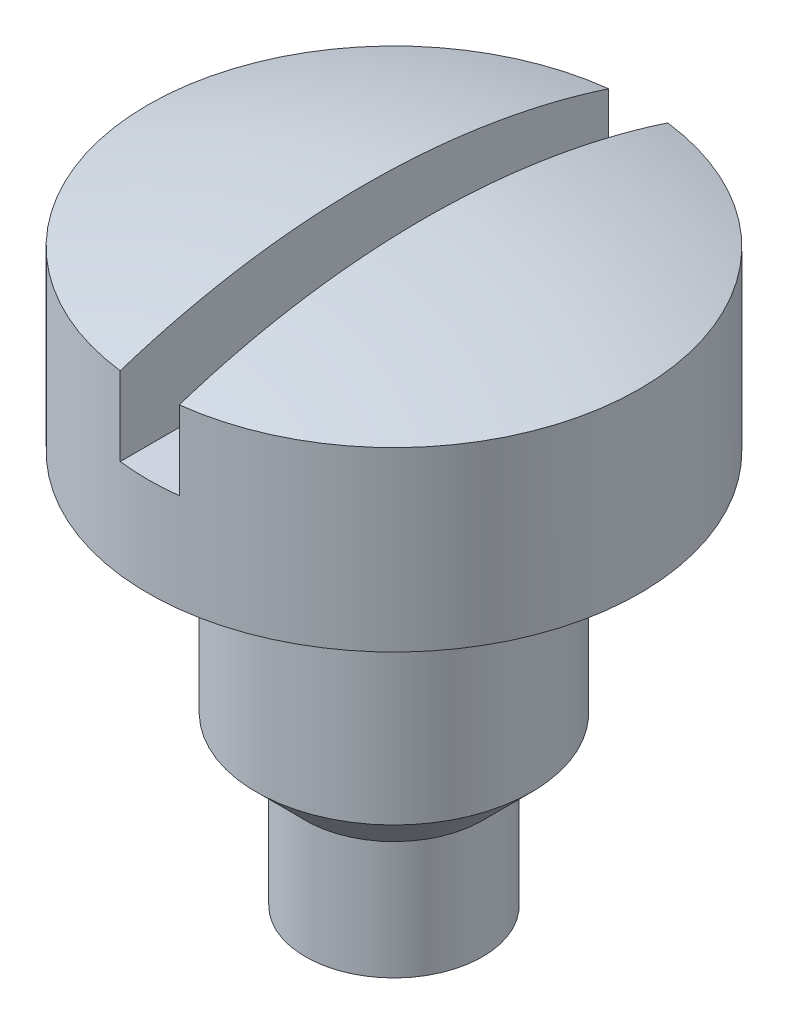
ISO-10303-21;
HEADER;
FILE_DESCRIPTION(('STEP AP214'),'2;1');
FILE_NAME('part.step','',(''),(''),'','','');
FILE_SCHEMA(('AUTOMOTIVE_DESIGN { 1 0 10303 214 1 1 1 1 }'));
ENDSEC;
DATA;
#1=APPLICATION_CONTEXT('core data for automotive mechanical design processes');
#2=APPLICATION_PROTOCOL_DEFINITION('international standard','automotive_design',2000,#1);
#3=PRODUCT_CONTEXT('',#1,'mechanical');
#4=PRODUCT('Part','Part','',(#3));
#5=PRODUCT_RELATED_PRODUCT_CATEGORY('part','',(#4));
#6=PRODUCT_DEFINITION_FORMATION('','',#4);
#7=PRODUCT_DEFINITION_CONTEXT('part definition',#1,'design');
#8=PRODUCT_DEFINITION('design','',#6,#7);
#9=PRODUCT_DEFINITION_SHAPE('','',#8);
#10=(LENGTH_UNIT() NAMED_UNIT(*) SI_UNIT(.MILLI.,.METRE.));
#11=(NAMED_UNIT(*) PLANE_ANGLE_UNIT() SI_UNIT($,.RADIAN.));
#12=(NAMED_UNIT(*) SI_UNIT($,.STERADIAN.) SOLID_ANGLE_UNIT());
#13=UNCERTAINTY_MEASURE_WITH_UNIT(LENGTH_MEASURE(1.E-05),#10,'distance_accuracy_value','');
#14=(GEOMETRIC_REPRESENTATION_CONTEXT(3) GLOBAL_UNCERTAINTY_ASSIGNED_CONTEXT((#13)) GLOBAL_UNIT_ASSIGNED_CONTEXT((#10,
#11,#12)) REPRESENTATION_CONTEXT('',''));
#15=CARTESIAN_POINT('',(0.,0.,0.));
#16=DIRECTION('',(0.,0.,1.));
#17=DIRECTION('',(1.,0.,0.));
#18=AXIS2_PLACEMENT_3D('',#15,#16,#17);
#19=CARTESIAN_POINT('',(0.,-0.899999999999999,0.));
#20=DIRECTION('',(0.,-1.,0.));
#21=DIRECTION('',(-1.,0.,0.));
#22=AXIS2_PLACEMENT_3D('',#19,#20,#21);
#23=SPHERICAL_SURFACE('',#22,4.);
#24=CARTESIAN_POINT('',(0.15,-0.899999999999999,0.));
#25=DIRECTION('',(1.,0.,0.));
#26=DIRECTION('',(0.,1.,0.));
#27=AXIS2_PLACEMENT_3D('',#24,#25,#26);
#28=CIRCLE('',#27,3.99718651053463);
#29=CARTESIAN_POINT('',(0.15,2.89967103839267,-1.24096736459908));
#30=VERTEX_POINT('',#29);
#31=CARTESIAN_POINT('',(0.15,2.89967103839267,1.24096736459908));
#32=VERTEX_POINT('',#31);
#33=EDGE_CURVE('E74',#30,#32,#28,.T.);
#34=ORIENTED_EDGE('',*,*,#33,.T.);
#35=CARTESIAN_POINT('',(0.,2.89967103839267,0.));
#36=DIRECTION('',(0.,-1.,0.));
#37=DIRECTION('',(0.,0.,-1.));
#38=AXIS2_PLACEMENT_3D('',#35,#36,#37);
#39=CIRCLE('',#38,1.25);
#40=EDGE_CURVE('E129',#30,#32,#39,.T.);
#41=ORIENTED_EDGE('',*,*,#40,.F.);
#42=EDGE_LOOP('',(#34,#41));
#43=FACE_BOUND('',#42,.T.);
#44=ADVANCED_FACE('F52',(#43),#23,.T.);
#45=CARTESIAN_POINT('',(0.,2.,0.));
#46=DIRECTION('',(0.,-1.,0.));
#47=DIRECTION('',(0.,0.,-1.));
#48=AXIS2_PLACEMENT_3D('',#45,#46,#47);
#49=CYLINDRICAL_SURFACE('',#48,0.7);
#50=CARTESIAN_POINT('',(0.,0.850000000000002,0.));
#51=DIRECTION('',(0.,-1.,0.));
#52=DIRECTION('',(0.,0.,-1.));
#53=AXIS2_PLACEMENT_3D('',#50,#51,#52);
#54=CIRCLE('',#53,0.7);
#55=CARTESIAN_POINT('',(0.,0.850000000000002,-0.7));
#56=VERTEX_POINT('',#55);
#57=EDGE_CURVE('E132',#56,#56,#54,.F.);
#58=ORIENTED_EDGE('',*,*,#57,.T.);
#59=EDGE_LOOP('',(#58));
#60=FACE_BOUND('',#59,.T.);
#61=CARTESIAN_POINT('',(0.,2.,0.));
#62=DIRECTION('',(0.,-1.,0.));
#63=DIRECTION('',(0.,0.,-1.));
#64=AXIS2_PLACEMENT_3D('',#61,#62,#63);
#65=CIRCLE('',#64,0.7);
#66=CARTESIAN_POINT('',(0.,2.,-0.7));
#67=VERTEX_POINT('',#66);
#68=EDGE_CURVE('E122',#67,#67,#65,.T.);
#69=ORIENTED_EDGE('',*,*,#68,.T.);
#70=EDGE_LOOP('',(#69));
#71=FACE_BOUND('',#70,.T.);
#72=ADVANCED_FACE('F141',(#60,#71),#49,.T.);
#73=CARTESIAN_POINT('',(0.,3.1,0.));
#74=DIRECTION('',(0.,-1.,0.));
#75=DIRECTION('',(0.,0.,-1.));
#76=AXIS2_PLACEMENT_3D('',#73,#74,#75);
#77=CYLINDRICAL_SURFACE('',#76,1.25);
#78=CARTESIAN_POINT('',(0.,2.5,0.));
#79=DIRECTION('',(0.,-1.,0.));
#80=DIRECTION('',(0.,0.,-1.));
#81=AXIS2_PLACEMENT_3D('',#78,#79,#80);
#82=CIRCLE('',#81,1.25);
#83=CARTESIAN_POINT('',(-0.15,2.5,-1.24096736459909));
#84=VERTEX_POINT('',#83);
#85=CARTESIAN_POINT('',(0.15,2.5,-1.24096736459909));
#86=VERTEX_POINT('',#85);
#87=EDGE_CURVE('E14',#84,#86,#82,.T.);
#88=ORIENTED_EDGE('',*,*,#87,.T.);
#89=DIRECTION('',(0.,-1.,0.));
#90=VECTOR('',#89,1.);
#91=CARTESIAN_POINT('',(0.15,3.1,-1.24096736459909));
#92=LINE('',#91,#90);
#93=EDGE_CURVE('E110',#86,#30,#92,.F.);
#94=ORIENTED_EDGE('',*,*,#93,.T.);
#95=ORIENTED_EDGE('',*,*,#40,.T.);
#96=DIRECTION('',(0.,-1.,0.));
#97=VECTOR('',#96,1.);
#98=CARTESIAN_POINT('',(0.15,3.1,1.24096736459909));
#99=LINE('',#98,#97);
#100=CARTESIAN_POINT('',(0.15,2.5,1.24096736459909));
#101=VERTEX_POINT('',#100);
#102=EDGE_CURVE('E112',#32,#101,#99,.T.);
#103=ORIENTED_EDGE('',*,*,#102,.T.);
#104=CARTESIAN_POINT('',(-0.15,2.5,1.24096736459909));
#105=VERTEX_POINT('',#104);
#106=EDGE_CURVE('E56',#101,#105,#82,.T.);
#107=ORIENTED_EDGE('',*,*,#106,.T.);
#108=DIRECTION('',(0.,-1.,0.));
#109=VECTOR('',#108,1.);
#110=CARTESIAN_POINT('',(-0.15,3.1,1.24096736459909));
#111=LINE('',#110,#109);
#112=CARTESIAN_POINT('',(-0.15,2.89967103839267,1.24096736459908));
#113=VERTEX_POINT('',#112);
#114=EDGE_CURVE('E103',#105,#113,#111,.F.);
#115=ORIENTED_EDGE('',*,*,#114,.T.);
#116=CARTESIAN_POINT('',(-0.15,2.89967103839267,-1.24096736459908));
#117=VERTEX_POINT('',#116);
#118=EDGE_CURVE('E109',#113,#117,#39,.T.);
#119=ORIENTED_EDGE('',*,*,#118,.T.);
#120=DIRECTION('',(0.,-1.,0.));
#121=VECTOR('',#120,1.);
#122=CARTESIAN_POINT('',(-0.15,3.1,-1.24096736459909));
#123=LINE('',#122,#121);
#124=EDGE_CURVE('E67',#117,#84,#123,.T.);
#125=ORIENTED_EDGE('',*,*,#124,.T.);
#126=EDGE_LOOP('',(#88,#94,#95,#103,#107,#115,#119,#125));
#127=FACE_BOUND('',#126,.T.);
#128=CARTESIAN_POINT('',(0.,2.,0.));
#129=DIRECTION('',(0.,-1.,0.));
#130=DIRECTION('',(0.,0.,-1.));
#131=AXIS2_PLACEMENT_3D('',#128,#129,#130);
#132=CIRCLE('',#131,1.25);
#133=CARTESIAN_POINT('',(0.,2.,-1.25));
#134=VERTEX_POINT('',#133);
#135=EDGE_CURVE('E127',#134,#134,#132,.T.);
#136=ORIENTED_EDGE('',*,*,#135,.F.);
#137=EDGE_LOOP('',(#136));
#138=FACE_BOUND('',#137,.T.);
#139=ADVANCED_FACE('F106',(#127,#138),#77,.T.);
#140=ORIENTED_EDGE('',*,*,#118,.F.);
#141=CARTESIAN_POINT('',(-0.15,-0.899999999999999,0.));
#142=DIRECTION('',(-1.,0.,0.));
#143=DIRECTION('',(0.,-1.,0.));
#144=AXIS2_PLACEMENT_3D('',#141,#142,#143);
#145=CIRCLE('',#144,3.99718651053463);
#146=EDGE_CURVE('E135',#113,#117,#145,.T.);
#147=ORIENTED_EDGE('',*,*,#146,.T.);
#148=EDGE_LOOP('',(#140,#147));
#149=FACE_BOUND('',#148,.T.);
#150=ADVANCED_FACE('F143',(#149),#23,.T.);
#151=CARTESIAN_POINT('',(0.,2.,0.));
#152=DIRECTION('',(0.,-1.,0.));
#153=DIRECTION('',(0.,0.,-1.));
#154=AXIS2_PLACEMENT_3D('',#151,#152,#153);
#155=PLANE('',#154);
#156=ORIENTED_EDGE('',*,*,#68,.F.);
#157=EDGE_LOOP('',(#156));
#158=FACE_BOUND('',#157,.T.);
#159=ORIENTED_EDGE('',*,*,#135,.T.);
#160=EDGE_LOOP('',(#159));
#161=FACE_BOUND('',#160,.T.);
#162=ADVANCED_FACE('F152',(#158,#161),#155,.T.);
#163=CARTESIAN_POINT('',(0.,0.6,0.));
#164=DIRECTION('',(0.,-1.,0.));
#165=DIRECTION('',(0.,0.,-1.));
#166=AXIS2_PLACEMENT_3D('',#163,#164,#165);
#167=CYLINDRICAL_SURFACE('',#166,0.45);
#168=CARTESIAN_POINT('',(0.,0.6,0.));
#169=DIRECTION('',(0.,-1.,0.));
#170=DIRECTION('',(0.,0.,-1.));
#171=AXIS2_PLACEMENT_3D('',#168,#169,#170);
#172=CIRCLE('',#171,0.45);
#173=CARTESIAN_POINT('',(0.,0.6,-0.45));
#174=VERTEX_POINT('',#173);
#175=EDGE_CURVE('E119',#174,#174,#172,.T.);
#176=ORIENTED_EDGE('',*,*,#175,.T.);
#177=EDGE_LOOP('',(#176));
#178=FACE_BOUND('',#177,.T.);
#179=CARTESIAN_POINT('',(0.,0.,0.));
#180=DIRECTION('',(0.,-1.,0.));
#181=DIRECTION('',(0.,0.,-1.));
#182=AXIS2_PLACEMENT_3D('',#179,#180,#181);
#183=CIRCLE('',#182,0.45);
#184=CARTESIAN_POINT('',(0.,0.,-0.45));
#185=VERTEX_POINT('',#184);
#186=EDGE_CURVE('E118',#185,#185,#183,.T.);
#187=ORIENTED_EDGE('',*,*,#186,.F.);
#188=EDGE_LOOP('',(#187));
#189=FACE_BOUND('',#188,.T.);
#190=ADVANCED_FACE('F158',(#178,#189),#167,.T.);
#191=CARTESIAN_POINT('',(0.,0.,0.));
#192=DIRECTION('',(0.,1.,0.));
#193=DIRECTION('',(0.,0.,1.));
#194=AXIS2_PLACEMENT_3D('',#191,#192,#193);
#195=PLANE('',#194);
#196=ORIENTED_EDGE('',*,*,#186,.T.);
#197=EDGE_LOOP('',(#196));
#198=FACE_BOUND('',#197,.T.);
#199=ADVANCED_FACE('F162',(#198),#195,.F.);
#200=CARTESIAN_POINT('',(0.,0.850000000000002,0.));
#201=DIRECTION('',(0.,1.,0.));
#202=DIRECTION('',(0.,0.,1.));
#203=AXIS2_PLACEMENT_3D('',#200,#201,#202);
#204=CONICAL_SURFACE('',#203,0.7,0.78539816339745);
#205=ORIENTED_EDGE('',*,*,#175,.F.);
#206=EDGE_LOOP('',(#205));
#207=FACE_BOUND('',#206,.T.);
#208=ORIENTED_EDGE('',*,*,#57,.F.);
#209=EDGE_LOOP('',(#208));
#210=FACE_BOUND('',#209,.T.);
#211=ADVANCED_FACE('F54',(#207,#210),#204,.T.);
#212=CARTESIAN_POINT('',(-0.15,2.5,-1.25));
#213=DIRECTION('',(0.,-1.,0.));
#214=DIRECTION('',(0.,0.,-1.));
#215=AXIS2_PLACEMENT_3D('',#212,#213,#214);
#216=PLANE('',#215);
#217=DIRECTION('',(0.,0.,1.));
#218=VECTOR('',#217,1.);
#219=CARTESIAN_POINT('',(0.15,2.5,-1.25));
#220=LINE('',#219,#218);
#221=EDGE_CURVE('E97',#86,#101,#220,.T.);
#222=ORIENTED_EDGE('',*,*,#221,.F.);
#223=ORIENTED_EDGE('',*,*,#87,.F.);
#224=DIRECTION('',(0.,0.,1.));
#225=VECTOR('',#224,1.);
#226=CARTESIAN_POINT('',(-0.15,2.5,-1.25));
#227=LINE('',#226,#225);
#228=EDGE_CURVE('E94',#84,#105,#227,.T.);
#229=ORIENTED_EDGE('',*,*,#228,.T.);
#230=ORIENTED_EDGE('',*,*,#106,.F.);
#231=EDGE_LOOP('',(#222,#223,#229,#230));
#232=FACE_BOUND('',#231,.T.);
#233=ADVANCED_FACE('F93',(#232),#216,.F.);
#234=CARTESIAN_POINT('',(0.15,3.09718651053463,-1.25));
#235=DIRECTION('',(1.,0.,0.));
#236=DIRECTION('',(0.,1.,0.));
#237=AXIS2_PLACEMENT_3D('',#234,#235,#236);
#238=PLANE('',#237);
#239=ORIENTED_EDGE('',*,*,#102,.F.);
#240=ORIENTED_EDGE('',*,*,#33,.F.);
#241=ORIENTED_EDGE('',*,*,#93,.F.);
#242=ORIENTED_EDGE('',*,*,#221,.T.);
#243=EDGE_LOOP('',(#239,#240,#241,#242));
#244=FACE_BOUND('',#243,.T.);
#245=ADVANCED_FACE('F138',(#244),#238,.F.);
#246=CARTESIAN_POINT('',(-0.15,3.09718651053463,-1.25));
#247=DIRECTION('',(-1.,0.,0.));
#248=DIRECTION('',(0.,-1.,0.));
#249=AXIS2_PLACEMENT_3D('',#246,#247,#248);
#250=PLANE('',#249);
#251=ORIENTED_EDGE('',*,*,#146,.F.);
#252=ORIENTED_EDGE('',*,*,#114,.F.);
#253=ORIENTED_EDGE('',*,*,#228,.F.);
#254=ORIENTED_EDGE('',*,*,#124,.F.);
#255=EDGE_LOOP('',(#251,#252,#253,#254));
#256=FACE_BOUND('',#255,.T.);
#257=ADVANCED_FACE('F101',(#256),#250,.F.);
#258=CLOSED_SHELL('',(#44,#72,#139,#150,#162,#190,#199,#211,#233,#245,#257));
#259=MANIFOLD_SOLID_BREP('B2',#258);
#260=ADVANCED_BREP_SHAPE_REPRESENTATION('',(#18,#259),#14);
#261=SHAPE_DEFINITION_REPRESENTATION(#9,#260);
ENDSEC;
END-ISO-10303-21;
